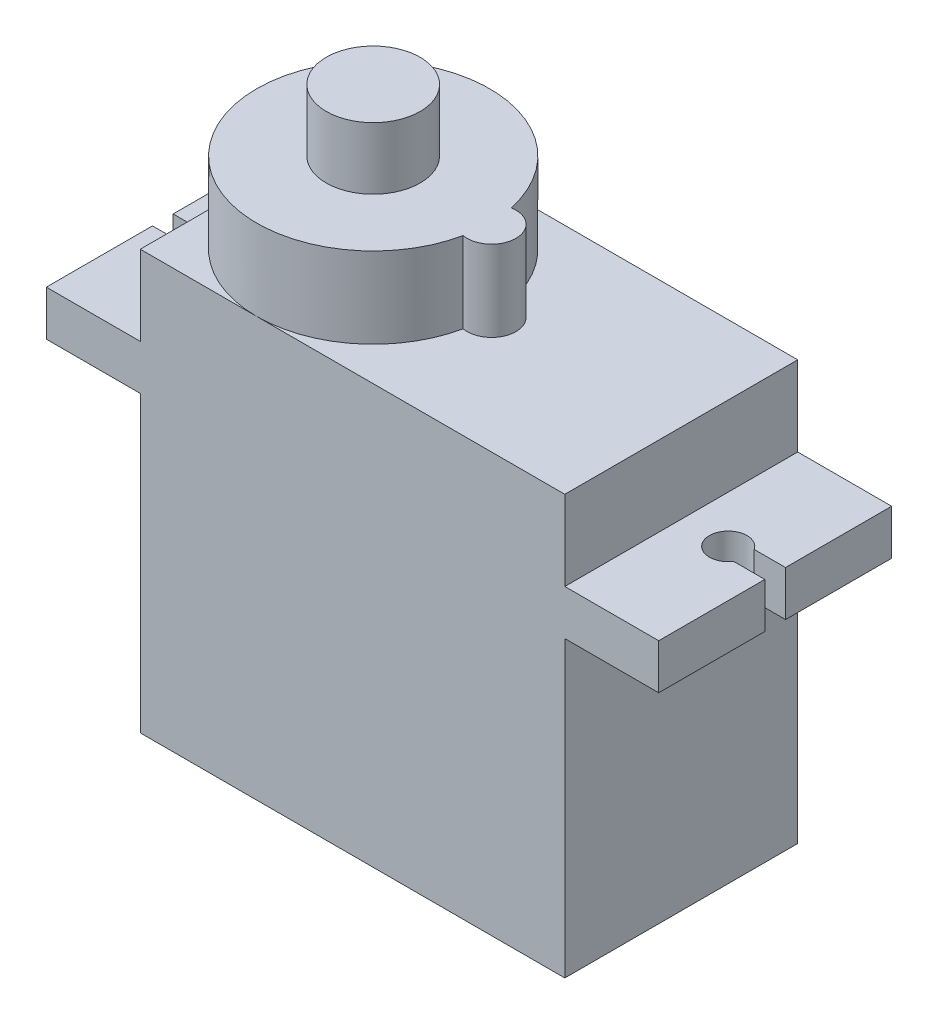
ISO-10303-21;
HEADER;
FILE_DESCRIPTION(('STEP AP214'),'2;1');
FILE_NAME('part.step','',(''),(''),'','','');
FILE_SCHEMA(('AUTOMOTIVE_DESIGN { 1 0 10303 214 1 1 1 1 }'));
ENDSEC;
DATA;
#1=APPLICATION_CONTEXT('core data for automotive mechanical design processes');
#2=APPLICATION_PROTOCOL_DEFINITION('international standard','automotive_design',2000,#1);
#3=PRODUCT_CONTEXT('',#1,'mechanical');
#4=PRODUCT('Part','Part','',(#3));
#5=PRODUCT_RELATED_PRODUCT_CATEGORY('part','',(#4));
#6=PRODUCT_DEFINITION_FORMATION('','',#4);
#7=PRODUCT_DEFINITION_CONTEXT('part definition',#1,'design');
#8=PRODUCT_DEFINITION('design','',#6,#7);
#9=PRODUCT_DEFINITION_SHAPE('','',#8);
#10=(LENGTH_UNIT() NAMED_UNIT(*) SI_UNIT(.MILLI.,.METRE.));
#11=(NAMED_UNIT(*) PLANE_ANGLE_UNIT() SI_UNIT($,.RADIAN.));
#12=(NAMED_UNIT(*) SI_UNIT($,.STERADIAN.) SOLID_ANGLE_UNIT());
#13=UNCERTAINTY_MEASURE_WITH_UNIT(LENGTH_MEASURE(1.E-05),#10,'distance_accuracy_value','');
#14=(GEOMETRIC_REPRESENTATION_CONTEXT(3) GLOBAL_UNCERTAINTY_ASSIGNED_CONTEXT((#13)) GLOBAL_UNIT_ASSIGNED_CONTEXT((#10,
#11,#12)) REPRESENTATION_CONTEXT('',''));
#15=CARTESIAN_POINT('',(0.,0.,0.));
#16=DIRECTION('',(0.,0.,1.));
#17=DIRECTION('',(1.,0.,0.));
#18=AXIS2_PLACEMENT_3D('',#15,#16,#17);
#19=CARTESIAN_POINT('',(-13.6,4.5,1.2));
#20=DIRECTION('',(1.,0.,0.));
#21=DIRECTION('',(0.,0.,-1.));
#22=AXIS2_PLACEMENT_3D('',#19,#20,#21);
#23=CYLINDRICAL_SURFACE('',#22,0.6);
#24=CARTESIAN_POINT('',(-13.6,4.5,1.2));
#25=DIRECTION('',(-1.,0.,0.));
#26=DIRECTION('',(0.,0.,1.));
#27=AXIS2_PLACEMENT_3D('',#24,#25,#26);
#28=CIRCLE('',#27,0.6);
#29=CARTESIAN_POINT('',(-13.6,4.5,1.8));
#30=VERTEX_POINT('',#29);
#31=EDGE_CURVE('E12',#30,#30,#28,.T.);
#32=ORIENTED_EDGE('',*,*,#31,.F.);
#33=EDGE_LOOP('',(#32));
#34=FACE_BOUND('',#33,.T.);
#35=CARTESIAN_POINT('',(-11.3,4.5,1.2));
#36=DIRECTION('',(-1.,0.,0.));
#37=DIRECTION('',(0.,0.,1.));
#38=AXIS2_PLACEMENT_3D('',#35,#36,#37);
#39=CIRCLE('',#38,0.6);
#40=CARTESIAN_POINT('',(-11.3,4.5,1.8));
#41=VERTEX_POINT('',#40);
#42=EDGE_CURVE('E56',#41,#41,#39,.T.);
#43=ORIENTED_EDGE('',*,*,#42,.T.);
#44=EDGE_LOOP('',(#43));
#45=FACE_BOUND('',#44,.T.);
#46=ADVANCED_FACE('F53',(#34,#45),#23,.T.);
#47=CARTESIAN_POINT('',(-13.6,0.,0.));
#48=DIRECTION('',(-1.,0.,0.));
#49=DIRECTION('',(0.,0.,1.));
#50=AXIS2_PLACEMENT_3D('',#47,#48,#49);
#51=PLANE('',#50);
#52=ORIENTED_EDGE('',*,*,#31,.T.);
#53=EDGE_LOOP('',(#52));
#54=FACE_BOUND('',#53,.T.);
#55=ADVANCED_FACE('F68',(#54),#51,.T.);
#56=CARTESIAN_POINT('',(-11.3,0.,0.));
#57=DIRECTION('',(-1.,0.,0.));
#58=DIRECTION('',(0.,0.,1.));
#59=AXIS2_PLACEMENT_3D('',#56,#57,#58);
#60=PLANE('',#59);
#61=ORIENTED_EDGE('',*,*,#42,.F.);
#62=EDGE_LOOP('',(#61));
#63=FACE_BOUND('',#62,.T.);
#64=ADVANCED_FACE('F66',(#63),#60,.F.);
#65=CLOSED_SHELL('',(#46,#55,#64));
#66=MANIFOLD_SOLID_BREP('B2',#65);
#67=CARTESIAN_POINT('',(-13.6,4.5,-1.2));
#68=DIRECTION('',(1.,0.,0.));
#69=DIRECTION('',(0.,0.,-1.));
#70=AXIS2_PLACEMENT_3D('',#67,#68,#69);
#71=CYLINDRICAL_SURFACE('',#70,0.6);
#72=CARTESIAN_POINT('',(-13.6,4.5,-1.2));
#73=DIRECTION('',(-1.,0.,0.));
#74=DIRECTION('',(0.,0.,1.));
#75=AXIS2_PLACEMENT_3D('',#72,#73,#74);
#76=CIRCLE('',#75,0.6);
#77=CARTESIAN_POINT('',(-13.6,4.5,-0.600000000000001));
#78=VERTEX_POINT('',#77);
#79=EDGE_CURVE('E52',#78,#78,#76,.T.);
#80=ORIENTED_EDGE('',*,*,#79,.F.);
#81=EDGE_LOOP('',(#80));
#82=FACE_BOUND('',#81,.T.);
#83=CARTESIAN_POINT('',(-11.3,4.5,-1.2));
#84=DIRECTION('',(-1.,0.,0.));
#85=DIRECTION('',(0.,0.,1.));
#86=AXIS2_PLACEMENT_3D('',#83,#84,#85);
#87=CIRCLE('',#86,0.6);
#88=CARTESIAN_POINT('',(-11.3,4.5,-0.600000000000001));
#89=VERTEX_POINT('',#88);
#90=EDGE_CURVE('E108',#89,#89,#87,.T.);
#91=ORIENTED_EDGE('',*,*,#90,.T.);
#92=EDGE_LOOP('',(#91));
#93=FACE_BOUND('',#92,.T.);
#94=ADVANCED_FACE('F105',(#82,#93),#71,.T.);
#95=CARTESIAN_POINT('',(-13.6,0.,0.));
#96=DIRECTION('',(-1.,0.,0.));
#97=DIRECTION('',(0.,0.,1.));
#98=AXIS2_PLACEMENT_3D('',#95,#96,#97);
#99=PLANE('',#98);
#100=ORIENTED_EDGE('',*,*,#79,.T.);
#101=EDGE_LOOP('',(#100));
#102=FACE_BOUND('',#101,.T.);
#103=ADVANCED_FACE('F120',(#102),#99,.T.);
#104=CARTESIAN_POINT('',(-11.3,0.,0.));
#105=DIRECTION('',(-1.,0.,0.));
#106=DIRECTION('',(0.,0.,1.));
#107=AXIS2_PLACEMENT_3D('',#104,#105,#106);
#108=PLANE('',#107);
#109=ORIENTED_EDGE('',*,*,#90,.F.);
#110=EDGE_LOOP('',(#109));
#111=FACE_BOUND('',#110,.T.);
#112=ADVANCED_FACE('F118',(#111),#108,.F.);
#113=CLOSED_SHELL('',(#94,#103,#112));
#114=MANIFOLD_SOLID_BREP('B7',#113);
#115=CARTESIAN_POINT('',(-13.6,4.5,0.));
#116=DIRECTION('',(1.,0.,0.));
#117=DIRECTION('',(0.,0.,-1.));
#118=AXIS2_PLACEMENT_3D('',#115,#116,#117);
#119=CYLINDRICAL_SURFACE('',#118,0.6);
#120=CARTESIAN_POINT('',(-13.6,4.5,0.));
#121=DIRECTION('',(-1.,0.,0.));
#122=DIRECTION('',(0.,0.,1.));
#123=AXIS2_PLACEMENT_3D('',#120,#121,#122);
#124=CIRCLE('',#123,0.6);
#125=CARTESIAN_POINT('',(-13.6,4.5,0.599999999999999));
#126=VERTEX_POINT('',#125);
#127=EDGE_CURVE('E104',#126,#126,#124,.T.);
#128=ORIENTED_EDGE('',*,*,#127,.F.);
#129=EDGE_LOOP('',(#128));
#130=FACE_BOUND('',#129,.T.);
#131=CARTESIAN_POINT('',(-11.3,4.5,0.));
#132=DIRECTION('',(-1.,0.,0.));
#133=DIRECTION('',(0.,0.,1.));
#134=AXIS2_PLACEMENT_3D('',#131,#132,#133);
#135=CIRCLE('',#134,0.6);
#136=CARTESIAN_POINT('',(-11.3,4.5,0.599999999999999));
#137=VERTEX_POINT('',#136);
#138=EDGE_CURVE('E161',#137,#137,#135,.T.);
#139=ORIENTED_EDGE('',*,*,#138,.T.);
#140=EDGE_LOOP('',(#139));
#141=FACE_BOUND('',#140,.T.);
#142=ADVANCED_FACE('F158',(#130,#141),#119,.T.);
#143=CARTESIAN_POINT('',(-13.6,0.,0.));
#144=DIRECTION('',(-1.,0.,0.));
#145=DIRECTION('',(0.,0.,1.));
#146=AXIS2_PLACEMENT_3D('',#143,#144,#145);
#147=PLANE('',#146);
#148=ORIENTED_EDGE('',*,*,#127,.T.);
#149=EDGE_LOOP('',(#148));
#150=FACE_BOUND('',#149,.T.);
#151=ADVANCED_FACE('F173',(#150),#147,.T.);
#152=CARTESIAN_POINT('',(-11.3,0.,0.));
#153=DIRECTION('',(-1.,0.,0.));
#154=DIRECTION('',(0.,0.,1.));
#155=AXIS2_PLACEMENT_3D('',#152,#153,#154);
#156=PLANE('',#155);
#157=ORIENTED_EDGE('',*,*,#138,.F.);
#158=EDGE_LOOP('',(#157));
#159=FACE_BOUND('',#158,.T.);
#160=ADVANCED_FACE('F171',(#159),#156,.F.);
#161=CLOSED_SHELL('',(#142,#151,#160));
#162=MANIFOLD_SOLID_BREP('B47',#161);
#163=CARTESIAN_POINT('',(0.,22.3,0.));
#164=DIRECTION('',(0.,-1.,0.));
#165=DIRECTION('',(0.,0.,-1.));
#166=AXIS2_PLACEMENT_3D('',#163,#164,#165);
#167=PLANE('',#166);
#168=CARTESIAN_POINT('',(1.2,22.3,0.));
#169=DIRECTION('',(0.,1.,0.));
#170=DIRECTION('',(0.,0.,1.));
#171=AXIS2_PLACEMENT_3D('',#168,#169,#170);
#172=CIRCLE('',#171,1.3);
#173=CARTESIAN_POINT('',(0.966666666666667,22.3,1.27888840621673));
#174=VERTEX_POINT('',#173);
#175=CARTESIAN_POINT('',(0.966666666666667,22.3,-1.27888840621673));
#176=VERTEX_POINT('',#175);
#177=EDGE_CURVE('E377',#174,#176,#172,.T.);
#178=ORIENTED_EDGE('',*,*,#177,.F.);
#179=CARTESIAN_POINT('',(-5.1,22.3,0.));
#180=DIRECTION('',(0.,1.,0.));
#181=DIRECTION('',(0.,0.,1.));
#182=AXIS2_PLACEMENT_3D('',#179,#180,#181);
#183=CIRCLE('',#182,6.2);
#184=CARTESIAN_POINT('',(-5.1,22.3,6.2));
#185=VERTEX_POINT('',#184);
#186=EDGE_CURVE('E225',#185,#174,#183,.T.);
#187=ORIENTED_EDGE('',*,*,#186,.F.);
#188=DIRECTION('',(1.,0.,0.));
#189=VECTOR('',#188,1.);
#190=CARTESIAN_POINT('',(-11.3,22.3,6.2));
#191=LINE('',#190,#189);
#192=CARTESIAN_POINT('',(11.3,22.3,6.2));
#193=VERTEX_POINT('',#192);
#194=EDGE_CURVE('E505',#185,#193,#191,.T.);
#195=ORIENTED_EDGE('',*,*,#194,.T.);
#196=DIRECTION('',(0.,0.,-1.));
#197=VECTOR('',#196,1.);
#198=CARTESIAN_POINT('',(11.3,22.3,6.2));
#199=LINE('',#198,#197);
#200=CARTESIAN_POINT('',(11.3,22.3,-6.2));
#201=VERTEX_POINT('',#200);
#202=EDGE_CURVE('E494',#193,#201,#199,.T.);
#203=ORIENTED_EDGE('',*,*,#202,.T.);
#204=DIRECTION('',(-1.,0.,0.));
#205=VECTOR('',#204,1.);
#206=CARTESIAN_POINT('',(-11.3,22.3,-6.2));
#207=LINE('',#206,#205);
#208=CARTESIAN_POINT('',(-5.1,22.3,-6.2));
#209=VERTEX_POINT('',#208);
#210=EDGE_CURVE('E499',#201,#209,#207,.T.);
#211=ORIENTED_EDGE('',*,*,#210,.T.);
#212=EDGE_CURVE('E219',#176,#209,#183,.T.);
#213=ORIENTED_EDGE('',*,*,#212,.F.);
#214=EDGE_LOOP('',(#178,#187,#195,#203,#211,#213));
#215=FACE_BOUND('',#214,.T.);
#216=ADVANCED_FACE('F202',(#215),#167,.F.);
#217=CARTESIAN_POINT('',(-11.3,22.3,0.));
#218=VERTEX_POINT('',#217);
#219=EDGE_CURVE('E211',#209,#218,#183,.T.);
#220=ORIENTED_EDGE('',*,*,#219,.F.);
#221=CARTESIAN_POINT('',(-11.3,22.3,-6.2));
#222=VERTEX_POINT('',#221);
#223=EDGE_CURVE('E497',#209,#222,#207,.T.);
#224=ORIENTED_EDGE('',*,*,#223,.T.);
#225=DIRECTION('',(0.,0.,1.));
#226=VECTOR('',#225,1.);
#227=CARTESIAN_POINT('',(-11.3,22.3,6.2));
#228=LINE('',#227,#226);
#229=EDGE_CURVE('E502',#222,#218,#228,.T.);
#230=ORIENTED_EDGE('',*,*,#229,.T.);
#231=EDGE_LOOP('',(#220,#224,#230));
#232=FACE_BOUND('',#231,.T.);
#233=ADVANCED_FACE('F595',(#232),#167,.F.);
#234=CARTESIAN_POINT('',(16.3,0.,0.));
#235=DIRECTION('',(1.,0.,0.));
#236=DIRECTION('',(0.,0.,-1.));
#237=AXIS2_PLACEMENT_3D('',#234,#235,#236);
#238=PLANE('',#237);
#239=DIRECTION('',(0.,1.,0.));
#240=VECTOR('',#239,1.);
#241=CARTESIAN_POINT('',(16.3,-0.001000000000001,-0.550000000000001));
#242=LINE('',#241,#240);
#243=CARTESIAN_POINT('',(16.3,15.65,-0.550000000000001));
#244=VERTEX_POINT('',#243);
#245=CARTESIAN_POINT('',(16.3,18.05,-0.550000000000001));
#246=VERTEX_POINT('',#245);
#247=EDGE_CURVE('E404',#244,#246,#242,.T.);
#248=ORIENTED_EDGE('',*,*,#247,.F.);
#249=DIRECTION('',(0.,0.,-1.));
#250=VECTOR('',#249,1.);
#251=CARTESIAN_POINT('',(16.3,15.65,6.2));
#252=LINE('',#251,#250);
#253=CARTESIAN_POINT('',(16.3,15.65,-6.2));
#254=VERTEX_POINT('',#253);
#255=EDGE_CURVE('E466',#244,#254,#252,.T.);
#256=ORIENTED_EDGE('',*,*,#255,.T.);
#257=DIRECTION('',(0.,1.,0.));
#258=VECTOR('',#257,1.);
#259=CARTESIAN_POINT('',(16.3,18.05,-6.2));
#260=LINE('',#259,#258);
#261=CARTESIAN_POINT('',(16.3,18.05,-6.2));
#262=VERTEX_POINT('',#261);
#263=EDGE_CURVE('E471',#254,#262,#260,.T.);
#264=ORIENTED_EDGE('',*,*,#263,.T.);
#265=DIRECTION('',(0.,0.,1.));
#266=VECTOR('',#265,1.);
#267=CARTESIAN_POINT('',(16.3,18.05,6.2));
#268=LINE('',#267,#266);
#269=EDGE_CURVE('E474',#262,#246,#268,.T.);
#270=ORIENTED_EDGE('',*,*,#269,.T.);
#271=EDGE_LOOP('',(#248,#256,#264,#270));
#272=FACE_BOUND('',#271,.T.);
#273=ADVANCED_FACE('F600',(#272),#238,.T.);
#274=CARTESIAN_POINT('',(-16.3,0.,0.));
#275=DIRECTION('',(-1.,0.,0.));
#276=DIRECTION('',(0.,0.,1.));
#277=AXIS2_PLACEMENT_3D('',#274,#275,#276);
#278=PLANE('',#277);
#279=DIRECTION('',(0.,1.,0.));
#280=VECTOR('',#279,1.);
#281=CARTESIAN_POINT('',(-16.3,-0.001000000000001,-0.55));
#282=LINE('',#281,#280);
#283=CARTESIAN_POINT('',(-16.3,15.65,-0.55));
#284=VERTEX_POINT('',#283);
#285=CARTESIAN_POINT('',(-16.3,18.05,-0.55));
#286=VERTEX_POINT('',#285);
#287=EDGE_CURVE('E424',#284,#286,#282,.T.);
#288=ORIENTED_EDGE('',*,*,#287,.T.);
#289=DIRECTION('',(0.,0.,-1.));
#290=VECTOR('',#289,1.);
#291=CARTESIAN_POINT('',(-16.3,18.05,6.2));
#292=LINE('',#291,#290);
#293=CARTESIAN_POINT('',(-16.3,18.05,-6.2));
#294=VERTEX_POINT('',#293);
#295=EDGE_CURVE('E437',#286,#294,#292,.T.);
#296=ORIENTED_EDGE('',*,*,#295,.T.);
#297=DIRECTION('',(0.,-1.,0.));
#298=VECTOR('',#297,1.);
#299=CARTESIAN_POINT('',(-16.3,18.05,-6.2));
#300=LINE('',#299,#298);
#301=CARTESIAN_POINT('',(-16.3,15.65,-6.2));
#302=VERTEX_POINT('',#301);
#303=EDGE_CURVE('E436',#294,#302,#300,.T.);
#304=ORIENTED_EDGE('',*,*,#303,.T.);
#305=DIRECTION('',(0.,0.,1.));
#306=VECTOR('',#305,1.);
#307=CARTESIAN_POINT('',(-16.3,15.65,-6.2));
#308=LINE('',#307,#306);
#309=EDGE_CURVE('E440',#302,#284,#308,.T.);
#310=ORIENTED_EDGE('',*,*,#309,.T.);
#311=EDGE_LOOP('',(#288,#296,#304,#310));
#312=FACE_BOUND('',#311,.T.);
#313=ADVANCED_FACE('F617',(#312),#278,.T.);
#314=CARTESIAN_POINT('',(-11.3,22.3,6.2));
#315=DIRECTION('',(1.,0.,0.));
#316=DIRECTION('',(0.,0.,-1.));
#317=AXIS2_PLACEMENT_3D('',#314,#315,#316);
#318=PLANE('',#317);
#319=DIRECTION('',(0.,0.,-1.));
#320=VECTOR('',#319,1.);
#321=CARTESIAN_POINT('',(-11.3,18.05,6.2));
#322=LINE('',#321,#320);
#323=CARTESIAN_POINT('',(-11.3,18.05,6.2));
#324=VERTEX_POINT('',#323);
#325=CARTESIAN_POINT('',(-11.3,18.05,-6.2));
#326=VERTEX_POINT('',#325);
#327=EDGE_CURVE('E411',#324,#326,#322,.T.);
#328=ORIENTED_EDGE('',*,*,#327,.F.);
#329=DIRECTION('',(0.,-1.,0.));
#330=VECTOR('',#329,1.);
#331=CARTESIAN_POINT('',(-11.3,22.3,6.2));
#332=LINE('',#331,#330);
#333=CARTESIAN_POINT('',(-11.3,22.3,6.2));
#334=VERTEX_POINT('',#333);
#335=EDGE_CURVE('E523',#334,#324,#332,.T.);
#336=ORIENTED_EDGE('',*,*,#335,.F.);
#337=EDGE_CURVE('E501',#218,#334,#228,.T.);
#338=ORIENTED_EDGE('',*,*,#337,.F.);
#339=ORIENTED_EDGE('',*,*,#229,.F.);
#340=DIRECTION('',(0.,-1.,0.));
#341=VECTOR('',#340,1.);
#342=CARTESIAN_POINT('',(-11.3,22.3,-6.2));
#343=LINE('',#342,#341);
#344=EDGE_CURVE('E526',#222,#326,#343,.T.);
#345=ORIENTED_EDGE('',*,*,#344,.T.);
#346=EDGE_LOOP('',(#328,#336,#338,#339,#345));
#347=FACE_BOUND('',#346,.T.);
#348=ADVANCED_FACE('F565',(#347),#318,.F.);
#349=DIRECTION('',(0.,0.,1.));
#350=VECTOR('',#349,1.);
#351=CARTESIAN_POINT('',(-11.3,15.65,-6.2));
#352=LINE('',#351,#350);
#353=CARTESIAN_POINT('',(-11.3,15.65,-6.2));
#354=VERTEX_POINT('',#353);
#355=CARTESIAN_POINT('',(-11.3,15.65,6.2));
#356=VERTEX_POINT('',#355);
#357=EDGE_CURVE('E448',#354,#356,#352,.T.);
#358=ORIENTED_EDGE('',*,*,#357,.F.);
#359=CARTESIAN_POINT('',(-11.3,0.,-6.2));
#360=VERTEX_POINT('',#359);
#361=EDGE_CURVE('E525',#354,#360,#343,.T.);
#362=ORIENTED_EDGE('',*,*,#361,.T.);
#363=DIRECTION('',(0.,0.,1.));
#364=VECTOR('',#363,1.);
#365=CARTESIAN_POINT('',(-11.3,0.,6.2));
#366=LINE('',#365,#364);
#367=CARTESIAN_POINT('',(-11.3,0.,6.2));
#368=VERTEX_POINT('',#367);
#369=EDGE_CURVE('E515',#360,#368,#366,.T.);
#370=ORIENTED_EDGE('',*,*,#369,.T.);
#371=EDGE_CURVE('E522',#356,#368,#332,.T.);
#372=ORIENTED_EDGE('',*,*,#371,.F.);
#373=EDGE_LOOP('',(#358,#362,#370,#372));
#374=FACE_BOUND('',#373,.T.);
#375=ADVANCED_FACE('F533',(#374),#318,.F.);
#376=CARTESIAN_POINT('',(11.3,22.3,6.2));
#377=DIRECTION('',(-1.,0.,0.));
#378=DIRECTION('',(0.,0.,1.));
#379=AXIS2_PLACEMENT_3D('',#376,#377,#378);
#380=PLANE('',#379);
#381=DIRECTION('',(0.,0.,1.));
#382=VECTOR('',#381,1.);
#383=CARTESIAN_POINT('',(11.3,18.05,6.2));
#384=LINE('',#383,#382);
#385=CARTESIAN_POINT('',(11.3,18.05,-6.2));
#386=VERTEX_POINT('',#385);
#387=CARTESIAN_POINT('',(11.3,18.05,6.2));
#388=VERTEX_POINT('',#387);
#389=EDGE_CURVE('E467',#386,#388,#384,.T.);
#390=ORIENTED_EDGE('',*,*,#389,.F.);
#391=DIRECTION('',(0.,-1.,0.));
#392=VECTOR('',#391,1.);
#393=CARTESIAN_POINT('',(11.3,22.3,-6.2));
#394=LINE('',#393,#392);
#395=EDGE_CURVE('E206',#201,#386,#394,.T.);
#396=ORIENTED_EDGE('',*,*,#395,.F.);
#397=ORIENTED_EDGE('',*,*,#202,.F.);
#398=DIRECTION('',(0.,-1.,0.));
#399=VECTOR('',#398,1.);
#400=CARTESIAN_POINT('',(11.3,22.3,6.2));
#401=LINE('',#400,#399);
#402=EDGE_CURVE('E520',#193,#388,#401,.T.);
#403=ORIENTED_EDGE('',*,*,#402,.T.);
#404=EDGE_LOOP('',(#390,#396,#397,#403));
#405=FACE_BOUND('',#404,.T.);
#406=ADVANCED_FACE('F204',(#405),#380,.F.);
#407=DIRECTION('',(0.,0.,-1.));
#408=VECTOR('',#407,1.);
#409=CARTESIAN_POINT('',(11.3,15.65,6.2));
#410=LINE('',#409,#408);
#411=CARTESIAN_POINT('',(11.3,15.65,6.2));
#412=VERTEX_POINT('',#411);
#413=CARTESIAN_POINT('',(11.3,15.65,-6.2));
#414=VERTEX_POINT('',#413);
#415=EDGE_CURVE('E462',#412,#414,#410,.T.);
#416=ORIENTED_EDGE('',*,*,#415,.F.);
#417=CARTESIAN_POINT('',(11.3,0.,6.2));
#418=VERTEX_POINT('',#417);
#419=EDGE_CURVE('E509',#412,#418,#401,.T.);
#420=ORIENTED_EDGE('',*,*,#419,.T.);
#421=DIRECTION('',(0.,0.,-1.));
#422=VECTOR('',#421,1.);
#423=CARTESIAN_POINT('',(11.3,0.,6.2));
#424=LINE('',#423,#422);
#425=CARTESIAN_POINT('',(11.3,0.,-6.2));
#426=VERTEX_POINT('',#425);
#427=EDGE_CURVE('E493',#418,#426,#424,.T.);
#428=ORIENTED_EDGE('',*,*,#427,.T.);
#429=EDGE_CURVE('E527',#414,#426,#394,.T.);
#430=ORIENTED_EDGE('',*,*,#429,.F.);
#431=EDGE_LOOP('',(#416,#420,#428,#430));
#432=FACE_BOUND('',#431,.T.);
#433=ADVANCED_FACE('F614',(#432),#380,.F.);
#434=CARTESIAN_POINT('',(-11.3,22.3,-6.2));
#435=DIRECTION('',(0.,0.,1.));
#436=DIRECTION('',(1.,0.,0.));
#437=AXIS2_PLACEMENT_3D('',#434,#435,#436);
#438=PLANE('',#437);
#439=DIRECTION('',(-1.,0.,0.));
#440=VECTOR('',#439,1.);
#441=CARTESIAN_POINT('',(-11.3,0.,-6.2));
#442=LINE('',#441,#440);
#443=EDGE_CURVE('E512',#426,#360,#442,.T.);
#444=ORIENTED_EDGE('',*,*,#443,.T.);
#445=ORIENTED_EDGE('',*,*,#361,.F.);
#446=DIRECTION('',(1.,0.,0.));
#447=VECTOR('',#446,1.);
#448=CARTESIAN_POINT('',(-16.3,15.65,-6.2));
#449=LINE('',#448,#447);
#450=EDGE_CURVE('E456',#302,#354,#449,.T.);
#451=ORIENTED_EDGE('',*,*,#450,.F.);
#452=ORIENTED_EDGE('',*,*,#303,.F.);
#453=DIRECTION('',(1.,0.,0.));
#454=VECTOR('',#453,1.);
#455=CARTESIAN_POINT('',(-16.3,18.05,-6.2));
#456=LINE('',#455,#454);
#457=EDGE_CURVE('E459',#294,#326,#456,.T.);
#458=ORIENTED_EDGE('',*,*,#457,.T.);
#459=ORIENTED_EDGE('',*,*,#344,.F.);
#460=ORIENTED_EDGE('',*,*,#223,.F.);
#461=ORIENTED_EDGE('',*,*,#210,.F.);
#462=ORIENTED_EDGE('',*,*,#395,.T.);
#463=DIRECTION('',(-1.,0.,0.));
#464=VECTOR('',#463,1.);
#465=CARTESIAN_POINT('',(16.3,18.05,-6.2));
#466=LINE('',#465,#464);
#467=EDGE_CURVE('E484',#262,#386,#466,.T.);
#468=ORIENTED_EDGE('',*,*,#467,.F.);
#469=ORIENTED_EDGE('',*,*,#263,.F.);
#470=DIRECTION('',(-1.,0.,0.));
#471=VECTOR('',#470,1.);
#472=CARTESIAN_POINT('',(16.3,15.65,-6.2));
#473=LINE('',#472,#471);
#474=EDGE_CURVE('E487',#254,#414,#473,.T.);
#475=ORIENTED_EDGE('',*,*,#474,.T.);
#476=ORIENTED_EDGE('',*,*,#429,.T.);
#477=EDGE_LOOP('',(#444,#445,#451,#452,#458,#459,#460,#461,#462,#468,#469,#475,#476));
#478=FACE_BOUND('',#477,.T.);
#479=ADVANCED_FACE('F539',(#478),#438,.F.);
#480=CARTESIAN_POINT('',(-11.3,22.3,6.2));
#481=DIRECTION('',(0.,0.,-1.));
#482=DIRECTION('',(-1.,0.,0.));
#483=AXIS2_PLACEMENT_3D('',#480,#481,#482);
#484=PLANE('',#483);
#485=DIRECTION('',(1.,0.,0.));
#486=VECTOR('',#485,1.);
#487=CARTESIAN_POINT('',(-11.3,0.,6.2));
#488=LINE('',#487,#486);
#489=EDGE_CURVE('E498',#368,#418,#488,.T.);
#490=ORIENTED_EDGE('',*,*,#489,.T.);
#491=ORIENTED_EDGE('',*,*,#419,.F.);
#492=DIRECTION('',(-1.,0.,0.));
#493=VECTOR('',#492,1.);
#494=CARTESIAN_POINT('',(16.3,15.65,6.2));
#495=LINE('',#494,#493);
#496=CARTESIAN_POINT('',(16.3,15.65,6.2));
#497=VERTEX_POINT('',#496);
#498=EDGE_CURVE('E490',#497,#412,#495,.T.);
#499=ORIENTED_EDGE('',*,*,#498,.F.);
#500=DIRECTION('',(0.,-1.,0.));
#501=VECTOR('',#500,1.);
#502=CARTESIAN_POINT('',(16.3,18.05,6.2));
#503=LINE('',#502,#501);
#504=CARTESIAN_POINT('',(16.3,18.05,6.2));
#505=VERTEX_POINT('',#504);
#506=EDGE_CURVE('E463',#505,#497,#503,.T.);
#507=ORIENTED_EDGE('',*,*,#506,.F.);
#508=DIRECTION('',(-1.,0.,0.));
#509=VECTOR('',#508,1.);
#510=CARTESIAN_POINT('',(16.3,18.05,6.2));
#511=LINE('',#510,#509);
#512=EDGE_CURVE('E477',#505,#388,#511,.T.);
#513=ORIENTED_EDGE('',*,*,#512,.T.);
#514=ORIENTED_EDGE('',*,*,#402,.F.);
#515=ORIENTED_EDGE('',*,*,#194,.F.);
#516=EDGE_CURVE('E506',#334,#185,#191,.T.);
#517=ORIENTED_EDGE('',*,*,#516,.F.);
#518=ORIENTED_EDGE('',*,*,#335,.T.);
#519=DIRECTION('',(1.,0.,0.));
#520=VECTOR('',#519,1.);
#521=CARTESIAN_POINT('',(-16.3,18.05,6.2));
#522=LINE('',#521,#520);
#523=CARTESIAN_POINT('',(-16.3,18.05,6.2));
#524=VERTEX_POINT('',#523);
#525=EDGE_CURVE('E445',#524,#324,#522,.T.);
#526=ORIENTED_EDGE('',*,*,#525,.F.);
#527=DIRECTION('',(0.,1.,0.));
#528=VECTOR('',#527,1.);
#529=CARTESIAN_POINT('',(-16.3,15.65,6.2));
#530=LINE('',#529,#528);
#531=CARTESIAN_POINT('',(-16.3,15.65,6.2));
#532=VERTEX_POINT('',#531);
#533=EDGE_CURVE('E443',#532,#524,#530,.T.);
#534=ORIENTED_EDGE('',*,*,#533,.F.);
#535=DIRECTION('',(1.,0.,0.));
#536=VECTOR('',#535,1.);
#537=CARTESIAN_POINT('',(-16.3,15.65,6.2));
#538=LINE('',#537,#536);
#539=EDGE_CURVE('E453',#532,#356,#538,.T.);
#540=ORIENTED_EDGE('',*,*,#539,.T.);
#541=ORIENTED_EDGE('',*,*,#371,.T.);
#542=EDGE_LOOP('',(#490,#491,#499,#507,#513,#514,#515,#517,#518,#526,#534,#540,#541));
#543=FACE_BOUND('',#542,.T.);
#544=ADVANCED_FACE('F545',(#543),#484,.F.);
#545=EDGE_CURVE('E572',#218,#185,#183,.T.);
#546=ORIENTED_EDGE('',*,*,#545,.F.);
#547=ORIENTED_EDGE('',*,*,#337,.T.);
#548=ORIENTED_EDGE('',*,*,#516,.T.);
#549=EDGE_LOOP('',(#546,#547,#548));
#550=FACE_BOUND('',#549,.T.);
#551=ADVANCED_FACE('F571',(#550),#167,.F.);
#552=CARTESIAN_POINT('',(0.,0.,0.));
#553=DIRECTION('',(0.,-1.,0.));
#554=DIRECTION('',(0.,0.,-1.));
#555=AXIS2_PLACEMENT_3D('',#552,#553,#554);
#556=PLANE('',#555);
#557=ORIENTED_EDGE('',*,*,#427,.F.);
#558=ORIENTED_EDGE('',*,*,#489,.F.);
#559=ORIENTED_EDGE('',*,*,#369,.F.);
#560=ORIENTED_EDGE('',*,*,#443,.F.);
#561=EDGE_LOOP('',(#557,#558,#559,#560));
#562=FACE_BOUND('',#561,.T.);
#563=ADVANCED_FACE('F542',(#562),#556,.T.);
#564=CARTESIAN_POINT('',(16.3,15.65,6.2));
#565=DIRECTION('',(0.,1.,0.));
#566=DIRECTION('',(0.,0.,1.));
#567=AXIS2_PLACEMENT_3D('',#564,#565,#566);
#568=PLANE('',#567);
#569=ORIENTED_EDGE('',*,*,#255,.F.);
#570=DIRECTION('',(1.,0.,0.));
#571=VECTOR('',#570,1.);
#572=CARTESIAN_POINT('',(16.3,15.65,-0.550000000000001));
#573=LINE('',#572,#571);
#574=CARTESIAN_POINT('',(14.6351646544245,15.65,-0.550000000000001));
#575=VERTEX_POINT('',#574);
#576=EDGE_CURVE('E389',#575,#244,#573,.T.);
#577=ORIENTED_EDGE('',*,*,#576,.F.);
#578=CARTESIAN_POINT('',(13.8,15.65,0.));
#579=DIRECTION('',(0.,1.,0.));
#580=DIRECTION('',(0.,0.,1.));
#581=AXIS2_PLACEMENT_3D('',#578,#579,#580);
#582=CIRCLE('',#581,1.);
#583=CARTESIAN_POINT('',(14.6351646544245,15.65,0.549999999999999));
#584=VERTEX_POINT('',#583);
#585=EDGE_CURVE('E386',#584,#575,#582,.F.);
#586=ORIENTED_EDGE('',*,*,#585,.F.);
#587=DIRECTION('',(-1.,0.,0.));
#588=VECTOR('',#587,1.);
#589=CARTESIAN_POINT('',(16.3,15.65,0.549999999999999));
#590=LINE('',#589,#588);
#591=CARTESIAN_POINT('',(16.3,15.65,0.549999999999999));
#592=VERTEX_POINT('',#591);
#593=EDGE_CURVE('E403',#592,#584,#590,.T.);
#594=ORIENTED_EDGE('',*,*,#593,.F.);
#595=EDGE_CURVE('E468',#497,#592,#252,.T.);
#596=ORIENTED_EDGE('',*,*,#595,.F.);
#597=ORIENTED_EDGE('',*,*,#498,.T.);
#598=ORIENTED_EDGE('',*,*,#415,.T.);
#599=ORIENTED_EDGE('',*,*,#474,.F.);
#600=EDGE_LOOP('',(#569,#577,#586,#594,#596,#597,#598,#599));
#601=FACE_BOUND('',#600,.T.);
#602=ADVANCED_FACE('F609',(#601),#568,.F.);
#603=CARTESIAN_POINT('',(16.3,18.05,6.2));
#604=DIRECTION('',(0.,-1.,0.));
#605=DIRECTION('',(0.,0.,-1.));
#606=AXIS2_PLACEMENT_3D('',#603,#604,#605);
#607=PLANE('',#606);
#608=CARTESIAN_POINT('',(13.8,18.05,0.));
#609=DIRECTION('',(0.,1.,0.));
#610=DIRECTION('',(0.,0.,1.));
#611=AXIS2_PLACEMENT_3D('',#608,#609,#610);
#612=CIRCLE('',#611,1.);
#613=CARTESIAN_POINT('',(14.6351646544245,18.05,-0.550000000000001));
#614=VERTEX_POINT('',#613);
#615=CARTESIAN_POINT('',(14.6351646544245,18.05,0.549999999999999));
#616=VERTEX_POINT('',#615);
#617=EDGE_CURVE('E392',#614,#616,#612,.T.);
#618=ORIENTED_EDGE('',*,*,#617,.F.);
#619=DIRECTION('',(-1.,0.,0.));
#620=VECTOR('',#619,1.);
#621=CARTESIAN_POINT('',(16.3,18.05,-0.550000000000001));
#622=LINE('',#621,#620);
#623=EDGE_CURVE('E397',#246,#614,#622,.T.);
#624=ORIENTED_EDGE('',*,*,#623,.F.);
#625=ORIENTED_EDGE('',*,*,#269,.F.);
#626=ORIENTED_EDGE('',*,*,#467,.T.);
#627=ORIENTED_EDGE('',*,*,#389,.T.);
#628=ORIENTED_EDGE('',*,*,#512,.F.);
#629=CARTESIAN_POINT('',(16.3,18.05,0.550000000000001));
#630=VERTEX_POINT('',#629);
#631=EDGE_CURVE('E473',#630,#505,#268,.T.);
#632=ORIENTED_EDGE('',*,*,#631,.F.);
#633=DIRECTION('',(1.,0.,0.));
#634=VECTOR('',#633,1.);
#635=CARTESIAN_POINT('',(16.3,18.05,0.549999999999999));
#636=LINE('',#635,#634);
#637=EDGE_CURVE('E395',#616,#630,#636,.T.);
#638=ORIENTED_EDGE('',*,*,#637,.F.);
#639=EDGE_LOOP('',(#618,#624,#625,#626,#627,#628,#632,#638));
#640=FACE_BOUND('',#639,.T.);
#641=ADVANCED_FACE('F800',(#640),#607,.F.);
#642=DIRECTION('',(0.,1.,0.));
#643=VECTOR('',#642,1.);
#644=CARTESIAN_POINT('',(16.3,-0.001000000000001,0.549999999999999));
#645=LINE('',#644,#643);
#646=EDGE_CURVE('E406',#592,#630,#645,.T.);
#647=ORIENTED_EDGE('',*,*,#646,.T.);
#648=ORIENTED_EDGE('',*,*,#631,.T.);
#649=ORIENTED_EDGE('',*,*,#506,.T.);
#650=ORIENTED_EDGE('',*,*,#595,.T.);
#651=EDGE_LOOP('',(#647,#648,#649,#650));
#652=FACE_BOUND('',#651,.T.);
#653=ADVANCED_FACE('F629',(#652),#238,.T.);
#654=CARTESIAN_POINT('',(-16.3,18.05,6.2));
#655=DIRECTION('',(0.,-1.,0.));
#656=DIRECTION('',(0.,0.,-1.));
#657=AXIS2_PLACEMENT_3D('',#654,#655,#656);
#658=PLANE('',#657);
#659=ORIENTED_EDGE('',*,*,#295,.F.);
#660=DIRECTION('',(-1.,0.,0.));
#661=VECTOR('',#660,1.);
#662=CARTESIAN_POINT('',(-16.3,18.05,-0.55));
#663=LINE('',#662,#661);
#664=CARTESIAN_POINT('',(-14.6351646544245,18.05,-0.55));
#665=VERTEX_POINT('',#664);
#666=EDGE_CURVE('E421',#665,#286,#663,.T.);
#667=ORIENTED_EDGE('',*,*,#666,.F.);
#668=CARTESIAN_POINT('',(-13.8,18.05,0.));
#669=DIRECTION('',(0.,1.,0.));
#670=DIRECTION('',(0.,0.,1.));
#671=AXIS2_PLACEMENT_3D('',#668,#669,#670);
#672=CIRCLE('',#671,1.);
#673=CARTESIAN_POINT('',(-14.6351646544245,18.05,0.55));
#674=VERTEX_POINT('',#673);
#675=EDGE_CURVE('E418',#674,#665,#672,.T.);
#676=ORIENTED_EDGE('',*,*,#675,.F.);
#677=DIRECTION('',(1.,0.,0.));
#678=VECTOR('',#677,1.);
#679=CARTESIAN_POINT('',(-16.3,18.05,0.55));
#680=LINE('',#679,#678);
#681=CARTESIAN_POINT('',(-16.3,18.05,0.55));
#682=VERTEX_POINT('',#681);
#683=EDGE_CURVE('E415',#682,#674,#680,.T.);
#684=ORIENTED_EDGE('',*,*,#683,.F.);
#685=EDGE_CURVE('E433',#524,#682,#292,.T.);
#686=ORIENTED_EDGE('',*,*,#685,.F.);
#687=ORIENTED_EDGE('',*,*,#525,.T.);
#688=ORIENTED_EDGE('',*,*,#327,.T.);
#689=ORIENTED_EDGE('',*,*,#457,.F.);
#690=EDGE_LOOP('',(#659,#667,#676,#684,#686,#687,#688,#689));
#691=FACE_BOUND('',#690,.T.);
#692=ADVANCED_FACE('F560',(#691),#658,.F.);
#693=CARTESIAN_POINT('',(-16.3,15.65,-6.2));
#694=DIRECTION('',(0.,1.,0.));
#695=DIRECTION('',(0.,0.,1.));
#696=AXIS2_PLACEMENT_3D('',#693,#694,#695);
#697=PLANE('',#696);
#698=CARTESIAN_POINT('',(-13.8,15.65,0.));
#699=DIRECTION('',(0.,1.,0.));
#700=DIRECTION('',(0.,0.,1.));
#701=AXIS2_PLACEMENT_3D('',#698,#699,#700);
#702=CIRCLE('',#701,1.);
#703=CARTESIAN_POINT('',(-14.6351646544245,15.65,-0.55));
#704=VERTEX_POINT('',#703);
#705=CARTESIAN_POINT('',(-14.6351646544245,15.65,0.55));
#706=VERTEX_POINT('',#705);
#707=EDGE_CURVE('E378',#704,#706,#702,.F.);
#708=ORIENTED_EDGE('',*,*,#707,.F.);
#709=DIRECTION('',(1.,0.,0.));
#710=VECTOR('',#709,1.);
#711=CARTESIAN_POINT('',(-16.3,15.65,-0.55));
#712=LINE('',#711,#710);
#713=EDGE_CURVE('E381',#284,#704,#712,.T.);
#714=ORIENTED_EDGE('',*,*,#713,.F.);
#715=ORIENTED_EDGE('',*,*,#309,.F.);
#716=ORIENTED_EDGE('',*,*,#450,.T.);
#717=ORIENTED_EDGE('',*,*,#357,.T.);
#718=ORIENTED_EDGE('',*,*,#539,.F.);
#719=CARTESIAN_POINT('',(-16.3,15.65,0.549999999999997));
#720=VERTEX_POINT('',#719);
#721=EDGE_CURVE('E439',#720,#532,#308,.T.);
#722=ORIENTED_EDGE('',*,*,#721,.F.);
#723=DIRECTION('',(-1.,0.,0.));
#724=VECTOR('',#723,1.);
#725=CARTESIAN_POINT('',(-16.3,15.65,0.55));
#726=LINE('',#725,#724);
#727=EDGE_CURVE('E390',#706,#720,#726,.T.);
#728=ORIENTED_EDGE('',*,*,#727,.F.);
#729=EDGE_LOOP('',(#708,#714,#715,#716,#717,#718,#722,#728));
#730=FACE_BOUND('',#729,.T.);
#731=ADVANCED_FACE('F551',(#730),#697,.F.);
#732=DIRECTION('',(0.,1.,0.));
#733=VECTOR('',#732,1.);
#734=CARTESIAN_POINT('',(-16.3,-0.001000000000001,0.55));
#735=LINE('',#734,#733);
#736=EDGE_CURVE('E423',#720,#682,#735,.T.);
#737=ORIENTED_EDGE('',*,*,#736,.F.);
#738=ORIENTED_EDGE('',*,*,#721,.T.);
#739=ORIENTED_EDGE('',*,*,#533,.T.);
#740=ORIENTED_EDGE('',*,*,#685,.T.);
#741=EDGE_LOOP('',(#737,#738,#739,#740));
#742=FACE_BOUND('',#741,.T.);
#743=ADVANCED_FACE('F623',(#742),#278,.T.);
#744=CARTESIAN_POINT('',(-16.3,-0.001000000000001,-0.55));
#745=DIRECTION('',(0.,0.,-1.));
#746=DIRECTION('',(-1.,0.,0.));
#747=AXIS2_PLACEMENT_3D('',#744,#745,#746);
#748=PLANE('',#747);
#749=ORIENTED_EDGE('',*,*,#713,.T.);
#750=DIRECTION('',(0.,1.,0.));
#751=VECTOR('',#750,1.);
#752=CARTESIAN_POINT('',(-14.6351646544245,-0.001000000000001,-0.55));
#753=LINE('',#752,#751);
#754=EDGE_CURVE('E427',#704,#665,#753,.T.);
#755=ORIENTED_EDGE('',*,*,#754,.T.);
#756=ORIENTED_EDGE('',*,*,#666,.T.);
#757=ORIENTED_EDGE('',*,*,#287,.F.);
#758=EDGE_LOOP('',(#749,#755,#756,#757));
#759=FACE_BOUND('',#758,.T.);
#760=ADVANCED_FACE('F633',(#759),#748,.F.);
#761=CARTESIAN_POINT('',(-13.8,-0.001000000000001,0.));
#762=DIRECTION('',(0.,1.,0.));
#763=DIRECTION('',(0.,0.,1.));
#764=AXIS2_PLACEMENT_3D('',#761,#762,#763);
#765=CYLINDRICAL_SURFACE('',#764,1.);
#766=ORIENTED_EDGE('',*,*,#707,.T.);
#767=DIRECTION('',(0.,1.,0.));
#768=VECTOR('',#767,1.);
#769=CARTESIAN_POINT('',(-14.6351646544245,-0.001000000000001,0.55));
#770=LINE('',#769,#768);
#771=EDGE_CURVE('E429',#706,#674,#770,.T.);
#772=ORIENTED_EDGE('',*,*,#771,.T.);
#773=ORIENTED_EDGE('',*,*,#675,.T.);
#774=ORIENTED_EDGE('',*,*,#754,.F.);
#775=EDGE_LOOP('',(#766,#772,#773,#774));
#776=FACE_BOUND('',#775,.T.);
#777=ADVANCED_FACE('F639',(#776),#765,.F.);
#778=CARTESIAN_POINT('',(-16.3,-0.001000000000001,0.55));
#779=DIRECTION('',(0.,0.,1.));
#780=DIRECTION('',(1.,0.,0.));
#781=AXIS2_PLACEMENT_3D('',#778,#779,#780);
#782=PLANE('',#781);
#783=ORIENTED_EDGE('',*,*,#727,.T.);
#784=ORIENTED_EDGE('',*,*,#736,.T.);
#785=ORIENTED_EDGE('',*,*,#683,.T.);
#786=ORIENTED_EDGE('',*,*,#771,.F.);
#787=EDGE_LOOP('',(#783,#784,#785,#786));
#788=FACE_BOUND('',#787,.T.);
#789=ADVANCED_FACE('F646',(#788),#782,.F.);
#790=CARTESIAN_POINT('',(13.8,-0.001000000000001,0.));
#791=DIRECTION('',(0.,1.,0.));
#792=DIRECTION('',(0.,0.,1.));
#793=AXIS2_PLACEMENT_3D('',#790,#791,#792);
#794=CYLINDRICAL_SURFACE('',#793,1.);
#795=ORIENTED_EDGE('',*,*,#585,.T.);
#796=DIRECTION('',(0.,1.,0.));
#797=VECTOR('',#796,1.);
#798=CARTESIAN_POINT('',(14.6351646544245,-0.001000000000001,-0.550000000000001));
#799=LINE('',#798,#797);
#800=EDGE_CURVE('E401',#575,#614,#799,.T.);
#801=ORIENTED_EDGE('',*,*,#800,.T.);
#802=ORIENTED_EDGE('',*,*,#617,.T.);
#803=DIRECTION('',(0.,1.,0.));
#804=VECTOR('',#803,1.);
#805=CARTESIAN_POINT('',(14.6351646544245,-0.001000000000001,0.549999999999999));
#806=LINE('',#805,#804);
#807=EDGE_CURVE('E400',#584,#616,#806,.T.);
#808=ORIENTED_EDGE('',*,*,#807,.F.);
#809=EDGE_LOOP('',(#795,#801,#802,#808));
#810=FACE_BOUND('',#809,.T.);
#811=ADVANCED_FACE('F654',(#810),#794,.F.);
#812=CARTESIAN_POINT('',(16.3,-0.001000000000001,-0.550000000000001));
#813=DIRECTION('',(0.,0.,-1.));
#814=DIRECTION('',(-1.,0.,0.));
#815=AXIS2_PLACEMENT_3D('',#812,#813,#814);
#816=PLANE('',#815);
#817=ORIENTED_EDGE('',*,*,#576,.T.);
#818=ORIENTED_EDGE('',*,*,#247,.T.);
#819=ORIENTED_EDGE('',*,*,#623,.T.);
#820=ORIENTED_EDGE('',*,*,#800,.F.);
#821=EDGE_LOOP('',(#817,#818,#819,#820));
#822=FACE_BOUND('',#821,.T.);
#823=ADVANCED_FACE('F658',(#822),#816,.F.);
#824=CARTESIAN_POINT('',(16.3,-0.001000000000001,0.549999999999999));
#825=DIRECTION('',(0.,0.,1.));
#826=DIRECTION('',(1.,0.,0.));
#827=AXIS2_PLACEMENT_3D('',#824,#825,#826);
#828=PLANE('',#827);
#829=ORIENTED_EDGE('',*,*,#593,.T.);
#830=ORIENTED_EDGE('',*,*,#807,.T.);
#831=ORIENTED_EDGE('',*,*,#637,.T.);
#832=ORIENTED_EDGE('',*,*,#646,.F.);
#833=EDGE_LOOP('',(#829,#830,#831,#832));
#834=FACE_BOUND('',#833,.T.);
#835=ADVANCED_FACE('F660',(#834),#828,.F.);
#836=CARTESIAN_POINT('',(1.2,26.6,0.));
#837=DIRECTION('',(0.,-1.,0.));
#838=DIRECTION('',(0.,0.,-1.));
#839=AXIS2_PLACEMENT_3D('',#836,#837,#838);
#840=CYLINDRICAL_SURFACE('',#839,1.3);
#841=ORIENTED_EDGE('',*,*,#177,.T.);
#842=DIRECTION('',(0.,-1.,0.));
#843=VECTOR('',#842,1.);
#844=CARTESIAN_POINT('',(0.966666666666667,26.6,-1.27888840621673));
#845=LINE('',#844,#843);
#846=CARTESIAN_POINT('',(0.966666666666667,26.6,-1.27888840621673));
#847=VERTEX_POINT('',#846);
#848=EDGE_CURVE('E365',#847,#176,#845,.T.);
#849=ORIENTED_EDGE('',*,*,#848,.F.);
#850=CARTESIAN_POINT('',(1.2,26.6,0.));
#851=DIRECTION('',(0.,1.,0.));
#852=DIRECTION('',(0.,0.,1.));
#853=AXIS2_PLACEMENT_3D('',#850,#851,#852);
#854=CIRCLE('',#853,1.3);
#855=CARTESIAN_POINT('',(0.966666666666667,26.6,1.27888840621673));
#856=VERTEX_POINT('',#855);
#857=EDGE_CURVE('E371',#856,#847,#854,.T.);
#858=ORIENTED_EDGE('',*,*,#857,.F.);
#859=DIRECTION('',(0.,-1.,0.));
#860=VECTOR('',#859,1.);
#861=CARTESIAN_POINT('',(0.966666666666667,26.6,1.27888840621673));
#862=LINE('',#861,#860);
#863=EDGE_CURVE('E368',#856,#174,#862,.T.);
#864=ORIENTED_EDGE('',*,*,#863,.T.);
#865=EDGE_LOOP('',(#841,#849,#858,#864));
#866=FACE_BOUND('',#865,.T.);
#867=ADVANCED_FACE('F376',(#866),#840,.T.);
#868=CARTESIAN_POINT('',(-5.1,26.6,0.));
#869=DIRECTION('',(0.,-1.,0.));
#870=DIRECTION('',(0.,0.,-1.));
#871=AXIS2_PLACEMENT_3D('',#868,#869,#870);
#872=CYLINDRICAL_SURFACE('',#871,6.2);
#873=ORIENTED_EDGE('',*,*,#212,.T.);
#874=ORIENTED_EDGE('',*,*,#219,.T.);
#875=ORIENTED_EDGE('',*,*,#545,.T.);
#876=ORIENTED_EDGE('',*,*,#186,.T.);
#877=ORIENTED_EDGE('',*,*,#863,.F.);
#878=CARTESIAN_POINT('',(-5.1,26.6,0.));
#879=DIRECTION('',(0.,1.,0.));
#880=DIRECTION('',(0.,0.,1.));
#881=AXIS2_PLACEMENT_3D('',#878,#879,#880);
#882=CIRCLE('',#881,6.2);
#883=EDGE_CURVE('E361',#847,#856,#882,.T.);
#884=ORIENTED_EDGE('',*,*,#883,.F.);
#885=ORIENTED_EDGE('',*,*,#848,.T.);
#886=EDGE_LOOP('',(#873,#874,#875,#876,#877,#884,#885));
#887=FACE_BOUND('',#886,.T.);
#888=ADVANCED_FACE('F363',(#887),#872,.T.);
#889=CARTESIAN_POINT('',(0.,26.6,0.));
#890=DIRECTION('',(0.,1.,0.));
#891=DIRECTION('',(0.,0.,1.));
#892=AXIS2_PLACEMENT_3D('',#889,#890,#891);
#893=PLANE('',#892);
#894=CARTESIAN_POINT('',(-5.1,26.6,0.));
#895=DIRECTION('',(0.,1.,0.));
#896=DIRECTION('',(0.,0.,1.));
#897=AXIS2_PLACEMENT_3D('',#894,#895,#896);
#898=CIRCLE('',#897,2.5);
#899=CARTESIAN_POINT('',(-5.1,26.6,2.5));
#900=VERTEX_POINT('',#899);
#901=EDGE_CURVE('E156',#900,#900,#898,.T.);
#902=ORIENTED_EDGE('',*,*,#901,.F.);
#903=EDGE_LOOP('',(#902));
#904=FACE_BOUND('',#903,.T.);
#905=ORIENTED_EDGE('',*,*,#857,.T.);
#906=ORIENTED_EDGE('',*,*,#883,.T.);
#907=EDGE_LOOP('',(#905,#906));
#908=FACE_BOUND('',#907,.T.);
#909=ADVANCED_FACE('F373',(#904,#908),#893,.T.);
#910=CARTESIAN_POINT('',(-5.1,29.9,0.));
#911=DIRECTION('',(0.,-1.,0.));
#912=DIRECTION('',(0.,0.,-1.));
#913=AXIS2_PLACEMENT_3D('',#910,#911,#912);
#914=CYLINDRICAL_SURFACE('',#913,2.5);
#915=CARTESIAN_POINT('',(-5.1,29.9,0.));
#916=DIRECTION('',(0.,1.,0.));
#917=DIRECTION('',(0.,0.,1.));
#918=AXIS2_PLACEMENT_3D('',#915,#916,#917);
#919=CIRCLE('',#918,2.5);
#920=CARTESIAN_POINT('',(-5.1,29.9,2.5));
#921=VERTEX_POINT('',#920);
#922=EDGE_CURVE('E575',#921,#921,#919,.T.);
#923=ORIENTED_EDGE('',*,*,#922,.F.);
#924=EDGE_LOOP('',(#923));
#925=FACE_BOUND('',#924,.T.);
#926=ORIENTED_EDGE('',*,*,#901,.T.);
#927=EDGE_LOOP('',(#926));
#928=FACE_BOUND('',#927,.T.);
#929=ADVANCED_FACE('F582',(#925,#928),#914,.T.);
#930=CARTESIAN_POINT('',(-5.1,29.9,0.));
#931=DIRECTION('',(0.,1.,0.));
#932=DIRECTION('',(0.,0.,1.));
#933=AXIS2_PLACEMENT_3D('',#930,#931,#932);
#934=PLANE('',#933);
#935=ORIENTED_EDGE('',*,*,#922,.T.);
#936=EDGE_LOOP('',(#935));
#937=FACE_BOUND('',#936,.T.);
#938=ADVANCED_FACE('F580',(#937),#934,.T.);
#939=CLOSED_SHELL('',(#216,#233,#273,#313,#348,#375,#406,#433,#479,#544,#551,#563,#602,#641,
#653,#692,#731,#743,#760,#777,#789,#811,#823,#835,#867,#888,#909,#929,#938));
#940=MANIFOLD_SOLID_BREP('B99',#939);
#941=ADVANCED_BREP_SHAPE_REPRESENTATION('',(#18,#66,#114,#162,#940),#14);
#942=SHAPE_DEFINITION_REPRESENTATION(#9,#941);
ENDSEC;
END-ISO-10303-21;
